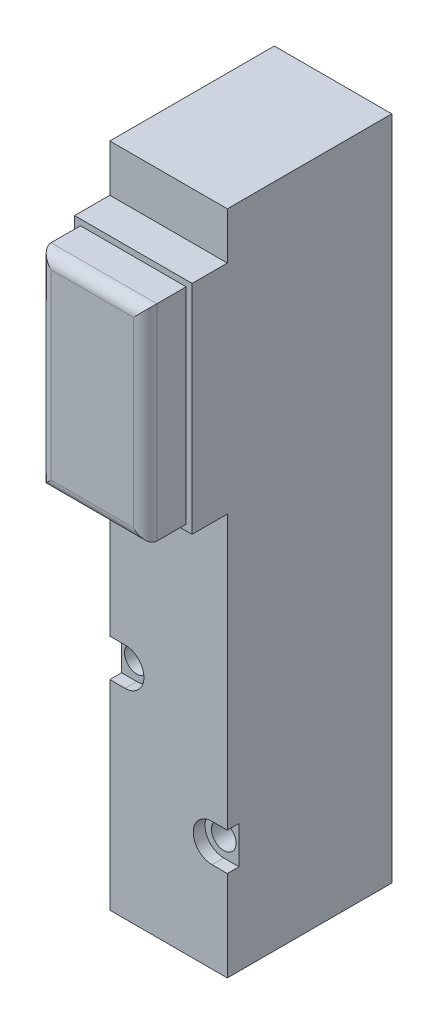
ISO-10303-21;
HEADER;
FILE_DESCRIPTION(('STEP AP214'),'2;1');
FILE_NAME('part.step','',(''),(''),'','','');
FILE_SCHEMA(('AUTOMOTIVE_DESIGN { 1 0 10303 214 1 1 1 1 }'));
ENDSEC;
DATA;
#1=APPLICATION_CONTEXT('core data for automotive mechanical design processes');
#2=APPLICATION_PROTOCOL_DEFINITION('international standard','automotive_design',2000,#1);
#3=PRODUCT_CONTEXT('',#1,'mechanical');
#4=PRODUCT('Part','Part','',(#3));
#5=PRODUCT_RELATED_PRODUCT_CATEGORY('part','',(#4));
#6=PRODUCT_DEFINITION_FORMATION('','',#4);
#7=PRODUCT_DEFINITION_CONTEXT('part definition',#1,'design');
#8=PRODUCT_DEFINITION('design','',#6,#7);
#9=PRODUCT_DEFINITION_SHAPE('','',#8);
#10=(LENGTH_UNIT() NAMED_UNIT(*) SI_UNIT(.MILLI.,.METRE.));
#11=(NAMED_UNIT(*) PLANE_ANGLE_UNIT() SI_UNIT($,.RADIAN.));
#12=(NAMED_UNIT(*) SI_UNIT($,.STERADIAN.) SOLID_ANGLE_UNIT());
#13=UNCERTAINTY_MEASURE_WITH_UNIT(LENGTH_MEASURE(1.E-05),#10,'distance_accuracy_value','');
#14=(GEOMETRIC_REPRESENTATION_CONTEXT(3) GLOBAL_UNCERTAINTY_ASSIGNED_CONTEXT((#13)) GLOBAL_UNIT_ASSIGNED_CONTEXT((#10,
#11,#12)) REPRESENTATION_CONTEXT('',''));
#15=CARTESIAN_POINT('',(0.,0.,0.));
#16=DIRECTION('',(0.,0.,1.));
#17=DIRECTION('',(1.,0.,0.));
#18=AXIS2_PLACEMENT_3D('',#15,#16,#17);
#19=CARTESIAN_POINT('',(-5.,-22.498,10.));
#20=DIRECTION('',(0.,0.,1.));
#21=DIRECTION('',(1.,0.,0.));
#22=AXIS2_PLACEMENT_3D('',#19,#20,#21);
#23=PLANE('',#22);
#24=DIRECTION('',(0.,-1.,0.));
#25=VECTOR('',#24,1.);
#26=CARTESIAN_POINT('',(-5.,-4.,10.));
#27=LINE('',#26,#25);
#28=CARTESIAN_POINT('',(-5.,-4.,10.));
#29=VERTEX_POINT('',#28);
#30=CARTESIAN_POINT('',(-5.,-22.498,10.));
#31=VERTEX_POINT('',#30);
#32=EDGE_CURVE('E352',#29,#31,#27,.T.);
#33=ORIENTED_EDGE('',*,*,#32,.T.);
#34=DIRECTION('',(1.,0.,0.));
#35=VECTOR('',#34,1.);
#36=CARTESIAN_POINT('',(-5.,-22.498,10.));
#37=LINE('',#36,#35);
#38=CARTESIAN_POINT('',(5.,-22.498,10.));
#39=VERTEX_POINT('',#38);
#40=EDGE_CURVE('E398',#31,#39,#37,.T.);
#41=ORIENTED_EDGE('',*,*,#40,.T.);
#42=DIRECTION('',(0.,1.,0.));
#43=VECTOR('',#42,1.);
#44=CARTESIAN_POINT('',(5.,-4.,10.));
#45=LINE('',#44,#43);
#46=CARTESIAN_POINT('',(5.,-4.,10.));
#47=VERTEX_POINT('',#46);
#48=EDGE_CURVE('E402',#39,#47,#45,.T.);
#49=ORIENTED_EDGE('',*,*,#48,.T.);
#50=DIRECTION('',(-1.,0.,0.));
#51=VECTOR('',#50,1.);
#52=CARTESIAN_POINT('',(-5.,-4.,10.));
#53=LINE('',#52,#51);
#54=EDGE_CURVE('E356',#47,#29,#53,.T.);
#55=ORIENTED_EDGE('',*,*,#54,.T.);
#56=EDGE_LOOP('',(#33,#41,#49,#55));
#57=FACE_BOUND('',#56,.T.);
#58=DIRECTION('',(0.,-1.,0.));
#59=VECTOR('',#58,1.);
#60=CARTESIAN_POINT('',(-4.5,-4.5,10.));
#61=LINE('',#60,#59);
#62=CARTESIAN_POINT('',(-4.5,-4.5,10.));
#63=VERTEX_POINT('',#62);
#64=CARTESIAN_POINT('',(-4.5,-21.998,10.));
#65=VERTEX_POINT('',#64);
#66=EDGE_CURVE('E198',#63,#65,#61,.T.);
#67=ORIENTED_EDGE('',*,*,#66,.F.);
#68=DIRECTION('',(-1.,0.,0.));
#69=VECTOR('',#68,1.);
#70=CARTESIAN_POINT('',(4.5,-4.5,10.));
#71=LINE('',#70,#69);
#72=CARTESIAN_POINT('',(4.5,-4.5,10.));
#73=VERTEX_POINT('',#72);
#74=EDGE_CURVE('E206',#73,#63,#71,.T.);
#75=ORIENTED_EDGE('',*,*,#74,.F.);
#76=DIRECTION('',(0.,1.,0.));
#77=VECTOR('',#76,1.);
#78=CARTESIAN_POINT('',(4.5,-21.998,10.));
#79=LINE('',#78,#77);
#80=CARTESIAN_POINT('',(4.5,-21.998,10.));
#81=VERTEX_POINT('',#80);
#82=EDGE_CURVE('E218',#81,#73,#79,.T.);
#83=ORIENTED_EDGE('',*,*,#82,.F.);
#84=DIRECTION('',(1.,0.,0.));
#85=VECTOR('',#84,1.);
#86=CARTESIAN_POINT('',(-4.5,-21.998,10.));
#87=LINE('',#86,#85);
#88=EDGE_CURVE('E216',#65,#81,#87,.T.);
#89=ORIENTED_EDGE('',*,*,#88,.F.);
#90=EDGE_LOOP('',(#67,#75,#83,#89));
#91=FACE_BOUND('',#90,.T.);
#92=ADVANCED_FACE('F33',(#57,#91),#23,.T.);
#93=CARTESIAN_POINT('',(-5.,-56.7,7.));
#94=DIRECTION('',(-1.,0.,0.));
#95=DIRECTION('',(0.,0.,1.));
#96=AXIS2_PLACEMENT_3D('',#93,#94,#95);
#97=PLANE('',#96);
#98=DIRECTION('',(0.,1.,0.));
#99=VECTOR('',#98,1.);
#100=CARTESIAN_POINT('',(-5.,-56.7,7.));
#101=LINE('',#100,#99);
#102=CARTESIAN_POINT('',(-5.,-56.7,7.));
#103=VERTEX_POINT('',#102);
#104=CARTESIAN_POINT('',(-5.,-39.7,7.));
#105=VERTEX_POINT('',#104);
#106=EDGE_CURVE('E381',#103,#105,#101,.T.);
#107=ORIENTED_EDGE('',*,*,#106,.T.);
#108=DIRECTION('',(0.,0.,1.));
#109=VECTOR('',#108,1.);
#110=CARTESIAN_POINT('',(-5.,-39.7,6.));
#111=LINE('',#110,#109);
#112=CARTESIAN_POINT('',(-5.,-39.7,6.));
#113=VERTEX_POINT('',#112);
#114=EDGE_CURVE('E252',#113,#105,#111,.T.);
#115=ORIENTED_EDGE('',*,*,#114,.F.);
#116=DIRECTION('',(0.,1.,0.));
#117=VECTOR('',#116,1.);
#118=CARTESIAN_POINT('',(-5.,-67.4571124722418,6.));
#119=LINE('',#118,#117);
#120=CARTESIAN_POINT('',(-5.,-36.5,6.));
#121=VERTEX_POINT('',#120);
#122=EDGE_CURVE('E242',#113,#121,#119,.T.);
#123=ORIENTED_EDGE('',*,*,#122,.T.);
#124=DIRECTION('',(0.,0.,1.));
#125=VECTOR('',#124,1.);
#126=CARTESIAN_POINT('',(-5.,-36.5,6.));
#127=LINE('',#126,#125);
#128=CARTESIAN_POINT('',(-5.,-36.5,7.));
#129=VERTEX_POINT('',#128);
#130=EDGE_CURVE('E254',#121,#129,#127,.T.);
#131=ORIENTED_EDGE('',*,*,#130,.T.);
#132=CARTESIAN_POINT('',(-5.,-22.498,7.));
#133=VERTEX_POINT('',#132);
#134=EDGE_CURVE('E366',#129,#133,#101,.T.);
#135=ORIENTED_EDGE('',*,*,#134,.T.);
#136=DIRECTION('',(0.,0.,-1.));
#137=VECTOR('',#136,1.);
#138=CARTESIAN_POINT('',(-5.,-22.498,10.));
#139=LINE('',#138,#137);
#140=EDGE_CURVE('E341',#31,#133,#139,.T.);
#141=ORIENTED_EDGE('',*,*,#140,.F.);
#142=ORIENTED_EDGE('',*,*,#32,.F.);
#143=DIRECTION('',(0.,0.,-1.));
#144=VECTOR('',#143,1.);
#145=CARTESIAN_POINT('',(-5.,-4.,10.));
#146=LINE('',#145,#144);
#147=CARTESIAN_POINT('',(-5.,-4.00000000000003,7.));
#148=VERTEX_POINT('',#147);
#149=EDGE_CURVE('E353',#29,#148,#146,.T.);
#150=ORIENTED_EDGE('',*,*,#149,.T.);
#151=CARTESIAN_POINT('',(-5.,0.,7.));
#152=VERTEX_POINT('',#151);
#153=EDGE_CURVE('E379',#148,#152,#101,.T.);
#154=ORIENTED_EDGE('',*,*,#153,.T.);
#155=DIRECTION('',(0.,0.,1.));
#156=VECTOR('',#155,1.);
#157=CARTESIAN_POINT('',(-5.,0.,7.));
#158=LINE('',#157,#156);
#159=CARTESIAN_POINT('',(-5.,0.,-7.));
#160=VERTEX_POINT('',#159);
#161=EDGE_CURVE('E347',#160,#152,#158,.T.);
#162=ORIENTED_EDGE('',*,*,#161,.F.);
#163=DIRECTION('',(0.,1.,0.));
#164=VECTOR('',#163,1.);
#165=CARTESIAN_POINT('',(-5.,-56.7,-7.));
#166=LINE('',#165,#164);
#167=CARTESIAN_POINT('',(-5.,-56.7,-7.));
#168=VERTEX_POINT('',#167);
#169=EDGE_CURVE('E429',#168,#160,#166,.T.);
#170=ORIENTED_EDGE('',*,*,#169,.F.);
#171=DIRECTION('',(0.,0.,1.));
#172=VECTOR('',#171,1.);
#173=CARTESIAN_POINT('',(-5.,-56.7,7.));
#174=LINE('',#173,#172);
#175=EDGE_CURVE('E420',#168,#103,#174,.T.);
#176=ORIENTED_EDGE('',*,*,#175,.T.);
#177=EDGE_LOOP('',(#107,#115,#123,#131,#135,#141,#142,#150,#154,#162,#170,#176));
#178=FACE_BOUND('',#177,.T.);
#179=ADVANCED_FACE('F35',(#178),#97,.T.);
#180=CARTESIAN_POINT('',(-5.,-56.7,7.));
#181=DIRECTION('',(0.,0.,1.));
#182=DIRECTION('',(1.,0.,0.));
#183=AXIS2_PLACEMENT_3D('',#180,#181,#182);
#184=PLANE('',#183);
#185=CARTESIAN_POINT('',(-3.7,-38.1,7.));
#186=DIRECTION('',(0.,0.,1.));
#187=DIRECTION('',(1.,0.,0.));
#188=AXIS2_PLACEMENT_3D('',#185,#186,#187);
#189=CIRCLE('',#188,1.6);
#190=CARTESIAN_POINT('',(-3.7,-39.7,7.));
#191=VERTEX_POINT('',#190);
#192=CARTESIAN_POINT('',(-3.7,-36.5,7.));
#193=VERTEX_POINT('',#192);
#194=EDGE_CURVE('E202',#191,#193,#189,.T.);
#195=ORIENTED_EDGE('',*,*,#194,.F.);
#196=DIRECTION('',(-1.,0.,0.));
#197=VECTOR('',#196,1.);
#198=CARTESIAN_POINT('',(0.,-39.7,7.));
#199=LINE('',#198,#197);
#200=EDGE_CURVE('E230',#191,#105,#199,.T.);
#201=ORIENTED_EDGE('',*,*,#200,.T.);
#202=ORIENTED_EDGE('',*,*,#106,.F.);
#203=DIRECTION('',(1.,0.,0.));
#204=VECTOR('',#203,1.);
#205=CARTESIAN_POINT('',(-5.,-56.7,7.));
#206=LINE('',#205,#204);
#207=CARTESIAN_POINT('',(5.,-56.7,7.));
#208=VERTEX_POINT('',#207);
#209=EDGE_CURVE('E422',#103,#208,#206,.T.);
#210=ORIENTED_EDGE('',*,*,#209,.T.);
#211=DIRECTION('',(0.,1.,0.));
#212=VECTOR('',#211,1.);
#213=CARTESIAN_POINT('',(5.,-56.7,7.));
#214=LINE('',#213,#212);
#215=CARTESIAN_POINT('',(5.,-49.,7.));
#216=VERTEX_POINT('',#215);
#217=EDGE_CURVE('E365',#208,#216,#214,.T.);
#218=ORIENTED_EDGE('',*,*,#217,.T.);
#219=DIRECTION('',(1.,0.,0.));
#220=VECTOR('',#219,1.);
#221=CARTESIAN_POINT('',(0.,-49.,7.));
#222=LINE('',#221,#220);
#223=CARTESIAN_POINT('',(3.7,-49.,7.));
#224=VERTEX_POINT('',#223);
#225=EDGE_CURVE('E264',#224,#216,#222,.T.);
#226=ORIENTED_EDGE('',*,*,#225,.F.);
#227=CARTESIAN_POINT('',(3.7,-47.4,7.));
#228=DIRECTION('',(0.,0.,1.));
#229=DIRECTION('',(1.,0.,0.));
#230=AXIS2_PLACEMENT_3D('',#227,#228,#229);
#231=CIRCLE('',#230,1.6);
#232=CARTESIAN_POINT('',(3.7,-45.8,7.));
#233=VERTEX_POINT('',#232);
#234=EDGE_CURVE('E261',#233,#224,#231,.T.);
#235=ORIENTED_EDGE('',*,*,#234,.F.);
#236=DIRECTION('',(1.,0.,0.));
#237=VECTOR('',#236,1.);
#238=CARTESIAN_POINT('',(0.,-45.8,7.));
#239=LINE('',#238,#237);
#240=CARTESIAN_POINT('',(5.,-45.8,7.));
#241=VERTEX_POINT('',#240);
#242=EDGE_CURVE('E251',#233,#241,#239,.T.);
#243=ORIENTED_EDGE('',*,*,#242,.T.);
#244=CARTESIAN_POINT('',(5.,-22.498,7.));
#245=VERTEX_POINT('',#244);
#246=EDGE_CURVE('E363',#241,#245,#214,.T.);
#247=ORIENTED_EDGE('',*,*,#246,.T.);
#248=DIRECTION('',(1.,0.,0.));
#249=VECTOR('',#248,1.);
#250=CARTESIAN_POINT('',(-5.,-22.498,7.));
#251=LINE('',#250,#249);
#252=EDGE_CURVE('E325',#133,#245,#251,.T.);
#253=ORIENTED_EDGE('',*,*,#252,.F.);
#254=ORIENTED_EDGE('',*,*,#134,.F.);
#255=DIRECTION('',(-1.,0.,0.));
#256=VECTOR('',#255,1.);
#257=CARTESIAN_POINT('',(0.,-36.5,7.));
#258=LINE('',#257,#256);
#259=EDGE_CURVE('E228',#193,#129,#258,.T.);
#260=ORIENTED_EDGE('',*,*,#259,.F.);
#261=EDGE_LOOP('',(#195,#201,#202,#210,#218,#226,#235,#243,#247,#253,#254,#260));
#262=FACE_BOUND('',#261,.T.);
#263=ADVANCED_FACE('F393',(#262),#184,.T.);
#264=CARTESIAN_POINT('',(-3.7,-38.1,-7.));
#265=DIRECTION('',(0.,0.,1.));
#266=DIRECTION('',(1.,0.,0.));
#267=AXIS2_PLACEMENT_3D('',#264,#265,#266);
#268=CYLINDRICAL_SURFACE('',#267,1.05);
#269=CARTESIAN_POINT('',(-3.7,-38.1,-7.));
#270=DIRECTION('',(0.,0.,1.));
#271=DIRECTION('',(1.,0.,0.));
#272=AXIS2_PLACEMENT_3D('',#269,#270,#271);
#273=CIRCLE('',#272,1.05);
#274=CARTESIAN_POINT('',(-2.65,-38.1,-7.));
#275=VERTEX_POINT('',#274);
#276=EDGE_CURVE('E292',#275,#275,#273,.T.);
#277=ORIENTED_EDGE('',*,*,#276,.F.);
#278=EDGE_LOOP('',(#277));
#279=FACE_BOUND('',#278,.T.);
#280=CARTESIAN_POINT('',(-3.7,-38.1,6.));
#281=DIRECTION('',(0.,0.,1.));
#282=DIRECTION('',(1.,0.,0.));
#283=AXIS2_PLACEMENT_3D('',#280,#281,#282);
#284=CIRCLE('',#283,1.05);
#285=CARTESIAN_POINT('',(-2.65,-38.1,6.));
#286=VERTEX_POINT('',#285);
#287=EDGE_CURVE('E233',#286,#286,#284,.T.);
#288=ORIENTED_EDGE('',*,*,#287,.T.);
#289=EDGE_LOOP('',(#288));
#290=FACE_BOUND('',#289,.T.);
#291=ADVANCED_FACE('F533',(#279,#290),#268,.F.);
#292=CARTESIAN_POINT('',(3.7,-47.4,-7.));
#293=DIRECTION('',(0.,0.,1.));
#294=DIRECTION('',(1.,0.,0.));
#295=AXIS2_PLACEMENT_3D('',#292,#293,#294);
#296=CYLINDRICAL_SURFACE('',#295,1.05);
#297=CARTESIAN_POINT('',(3.7,-47.4,-7.));
#298=DIRECTION('',(0.,0.,1.));
#299=DIRECTION('',(1.,0.,0.));
#300=AXIS2_PLACEMENT_3D('',#297,#298,#299);
#301=CIRCLE('',#300,1.05);
#302=CARTESIAN_POINT('',(4.75,-47.4,-7.));
#303=VERTEX_POINT('',#302);
#304=EDGE_CURVE('E284',#303,#303,#301,.T.);
#305=ORIENTED_EDGE('',*,*,#304,.F.);
#306=EDGE_LOOP('',(#305));
#307=FACE_BOUND('',#306,.T.);
#308=CARTESIAN_POINT('',(3.7,-47.4,6.));
#309=DIRECTION('',(0.,0.,1.));
#310=DIRECTION('',(1.,0.,0.));
#311=AXIS2_PLACEMENT_3D('',#308,#309,#310);
#312=CIRCLE('',#311,1.05);
#313=CARTESIAN_POINT('',(4.75,-47.4,6.));
#314=VERTEX_POINT('',#313);
#315=EDGE_CURVE('E266',#314,#314,#312,.T.);
#316=ORIENTED_EDGE('',*,*,#315,.T.);
#317=EDGE_LOOP('',(#316));
#318=FACE_BOUND('',#317,.T.);
#319=ADVANCED_FACE('F457',(#307,#318),#296,.F.);
#320=DIRECTION('',(-1.,0.,0.));
#321=VECTOR('',#320,1.);
#322=CARTESIAN_POINT('',(-5.,-4.,7.));
#323=LINE('',#322,#321);
#324=CARTESIAN_POINT('',(5.,-4.00000000000003,7.));
#325=VERTEX_POINT('',#324);
#326=EDGE_CURVE('E334',#325,#148,#323,.T.);
#327=ORIENTED_EDGE('',*,*,#326,.F.);
#328=CARTESIAN_POINT('',(5.,0.,7.));
#329=VERTEX_POINT('',#328);
#330=EDGE_CURVE('E335',#325,#329,#214,.T.);
#331=ORIENTED_EDGE('',*,*,#330,.T.);
#332=DIRECTION('',(1.,0.,0.));
#333=VECTOR('',#332,1.);
#334=CARTESIAN_POINT('',(-5.,0.,7.));
#335=LINE('',#334,#333);
#336=EDGE_CURVE('E411',#152,#329,#335,.T.);
#337=ORIENTED_EDGE('',*,*,#336,.F.);
#338=ORIENTED_EDGE('',*,*,#153,.F.);
#339=EDGE_LOOP('',(#327,#331,#337,#338));
#340=FACE_BOUND('',#339,.T.);
#341=ADVANCED_FACE('F446',(#340),#184,.T.);
#342=CARTESIAN_POINT('',(-5.,-56.7,-7.));
#343=DIRECTION('',(0.,0.,-1.));
#344=DIRECTION('',(-1.,0.,0.));
#345=AXIS2_PLACEMENT_3D('',#342,#343,#344);
#346=PLANE('',#345);
#347=ORIENTED_EDGE('',*,*,#304,.T.);
#348=EDGE_LOOP('',(#347));
#349=FACE_BOUND('',#348,.T.);
#350=ORIENTED_EDGE('',*,*,#276,.T.);
#351=EDGE_LOOP('',(#350));
#352=FACE_BOUND('',#351,.T.);
#353=CARTESIAN_POINT('',(0.,-36.2,-7.));
#354=DIRECTION('',(0.,0.,-1.));
#355=DIRECTION('',(-1.,0.,0.));
#356=AXIS2_PLACEMENT_3D('',#353,#354,#355);
#357=CIRCLE('',#356,1.25);
#358=CARTESIAN_POINT('',(-1.25,-36.2,-7.));
#359=VERTEX_POINT('',#358);
#360=EDGE_CURVE('E298',#359,#359,#357,.T.);
#361=ORIENTED_EDGE('',*,*,#360,.F.);
#362=EDGE_LOOP('',(#361));
#363=FACE_BOUND('',#362,.T.);
#364=CARTESIAN_POINT('',(0.,-42.6,-7.));
#365=DIRECTION('',(0.,0.,-1.));
#366=DIRECTION('',(-1.,0.,0.));
#367=AXIS2_PLACEMENT_3D('',#364,#365,#366);
#368=CIRCLE('',#367,1.25);
#369=CARTESIAN_POINT('',(-1.25,-42.6,-7.));
#370=VERTEX_POINT('',#369);
#371=EDGE_CURVE('E304',#370,#370,#368,.T.);
#372=ORIENTED_EDGE('',*,*,#371,.F.);
#373=EDGE_LOOP('',(#372));
#374=FACE_BOUND('',#373,.T.);
#375=CARTESIAN_POINT('',(0.,-49.,-7.));
#376=DIRECTION('',(0.,0.,-1.));
#377=DIRECTION('',(-1.,0.,0.));
#378=AXIS2_PLACEMENT_3D('',#375,#376,#377);
#379=CIRCLE('',#378,1.25);
#380=CARTESIAN_POINT('',(-1.25,-49.,-7.));
#381=VERTEX_POINT('',#380);
#382=EDGE_CURVE('E310',#381,#381,#379,.T.);
#383=ORIENTED_EDGE('',*,*,#382,.F.);
#384=EDGE_LOOP('',(#383));
#385=FACE_BOUND('',#384,.T.);
#386=CARTESIAN_POINT('',(-2.,-45.8,-7.));
#387=DIRECTION('',(0.,0.,-1.));
#388=DIRECTION('',(-1.,0.,0.));
#389=AXIS2_PLACEMENT_3D('',#386,#387,#388);
#390=CIRCLE('',#389,1.25);
#391=CARTESIAN_POINT('',(-3.25,-45.8,-7.));
#392=VERTEX_POINT('',#391);
#393=EDGE_CURVE('E316',#392,#392,#390,.T.);
#394=ORIENTED_EDGE('',*,*,#393,.F.);
#395=EDGE_LOOP('',(#394));
#396=FACE_BOUND('',#395,.T.);
#397=CARTESIAN_POINT('',(2.,-39.4,-7.));
#398=DIRECTION('',(0.,0.,-1.));
#399=DIRECTION('',(-1.,0.,0.));
#400=AXIS2_PLACEMENT_3D('',#397,#398,#399);
#401=CIRCLE('',#400,1.25);
#402=CARTESIAN_POINT('',(0.75,-39.4,-7.));
#403=VERTEX_POINT('',#402);
#404=EDGE_CURVE('E322',#403,#403,#401,.T.);
#405=ORIENTED_EDGE('',*,*,#404,.F.);
#406=EDGE_LOOP('',(#405));
#407=FACE_BOUND('',#406,.T.);
#408=DIRECTION('',(-1.,0.,0.));
#409=VECTOR('',#408,1.);
#410=CARTESIAN_POINT('',(-5.,0.,-7.));
#411=LINE('',#410,#409);
#412=CARTESIAN_POINT('',(5.,0.,-7.));
#413=VERTEX_POINT('',#412);
#414=EDGE_CURVE('E417',#413,#160,#411,.T.);
#415=ORIENTED_EDGE('',*,*,#414,.F.);
#416=DIRECTION('',(0.,1.,0.));
#417=VECTOR('',#416,1.);
#418=CARTESIAN_POINT('',(5.,-56.7,-7.));
#419=LINE('',#418,#417);
#420=CARTESIAN_POINT('',(5.,-56.7,-7.));
#421=VERTEX_POINT('',#420);
#422=EDGE_CURVE('E371',#421,#413,#419,.T.);
#423=ORIENTED_EDGE('',*,*,#422,.F.);
#424=DIRECTION('',(-1.,0.,0.));
#425=VECTOR('',#424,1.);
#426=CARTESIAN_POINT('',(-5.,-56.7,-7.));
#427=LINE('',#426,#425);
#428=EDGE_CURVE('E380',#421,#168,#427,.T.);
#429=ORIENTED_EDGE('',*,*,#428,.T.);
#430=ORIENTED_EDGE('',*,*,#169,.T.);
#431=EDGE_LOOP('',(#415,#423,#429,#430));
#432=FACE_BOUND('',#431,.T.);
#433=ADVANCED_FACE('F444',(#349,#352,#363,#374,#385,#396,#407,#432),#346,.T.);
#434=CARTESIAN_POINT('',(5.,-56.7,7.));
#435=DIRECTION('',(1.,0.,0.));
#436=DIRECTION('',(0.,0.,-1.));
#437=AXIS2_PLACEMENT_3D('',#434,#435,#436);
#438=PLANE('',#437);
#439=DIRECTION('',(0.,0.,1.));
#440=VECTOR('',#439,1.);
#441=CARTESIAN_POINT('',(5.,-49.,6.));
#442=LINE('',#441,#440);
#443=CARTESIAN_POINT('',(5.,-49.,6.));
#444=VERTEX_POINT('',#443);
#445=EDGE_CURVE('E281',#444,#216,#442,.T.);
#446=ORIENTED_EDGE('',*,*,#445,.T.);
#447=ORIENTED_EDGE('',*,*,#217,.F.);
#448=DIRECTION('',(0.,0.,-1.));
#449=VECTOR('',#448,1.);
#450=CARTESIAN_POINT('',(5.,-56.7,7.));
#451=LINE('',#450,#449);
#452=EDGE_CURVE('E425',#208,#421,#451,.T.);
#453=ORIENTED_EDGE('',*,*,#452,.T.);
#454=ORIENTED_EDGE('',*,*,#422,.T.);
#455=DIRECTION('',(0.,0.,-1.));
#456=VECTOR('',#455,1.);
#457=CARTESIAN_POINT('',(5.,0.,7.));
#458=LINE('',#457,#456);
#459=EDGE_CURVE('E414',#329,#413,#458,.T.);
#460=ORIENTED_EDGE('',*,*,#459,.F.);
#461=ORIENTED_EDGE('',*,*,#330,.F.);
#462=DIRECTION('',(0.,0.,-1.));
#463=VECTOR('',#462,1.);
#464=CARTESIAN_POINT('',(5.,-4.,10.));
#465=LINE('',#464,#463);
#466=EDGE_CURVE('E342',#47,#325,#465,.T.);
#467=ORIENTED_EDGE('',*,*,#466,.F.);
#468=ORIENTED_EDGE('',*,*,#48,.F.);
#469=DIRECTION('',(0.,0.,-1.));
#470=VECTOR('',#469,1.);
#471=CARTESIAN_POINT('',(5.,-22.498,10.));
#472=LINE('',#471,#470);
#473=EDGE_CURVE('E338',#39,#245,#472,.T.);
#474=ORIENTED_EDGE('',*,*,#473,.T.);
#475=ORIENTED_EDGE('',*,*,#246,.F.);
#476=DIRECTION('',(0.,0.,1.));
#477=VECTOR('',#476,1.);
#478=CARTESIAN_POINT('',(5.,-45.8,6.));
#479=LINE('',#478,#477);
#480=CARTESIAN_POINT('',(5.,-45.8,6.));
#481=VERTEX_POINT('',#480);
#482=EDGE_CURVE('E280',#481,#241,#479,.T.);
#483=ORIENTED_EDGE('',*,*,#482,.F.);
#484=DIRECTION('',(0.,1.,0.));
#485=VECTOR('',#484,1.);
#486=CARTESIAN_POINT('',(5.,-67.4571124722418,6.));
#487=LINE('',#486,#485);
#488=EDGE_CURVE('E269',#444,#481,#487,.T.);
#489=ORIENTED_EDGE('',*,*,#488,.F.);
#490=EDGE_LOOP('',(#446,#447,#453,#454,#460,#461,#467,#468,#474,#475,#483,#489));
#491=FACE_BOUND('',#490,.T.);
#492=ADVANCED_FACE('F437',(#491),#438,.T.);
#493=CARTESIAN_POINT('',(-5.,-56.7,7.));
#494=DIRECTION('',(0.,-1.,0.));
#495=DIRECTION('',(0.,0.,-1.));
#496=AXIS2_PLACEMENT_3D('',#493,#494,#495);
#497=PLANE('',#496);
#498=ORIENTED_EDGE('',*,*,#175,.F.);
#499=ORIENTED_EDGE('',*,*,#428,.F.);
#500=ORIENTED_EDGE('',*,*,#452,.F.);
#501=ORIENTED_EDGE('',*,*,#209,.F.);
#502=EDGE_LOOP('',(#498,#499,#500,#501));
#503=FACE_BOUND('',#502,.T.);
#504=ADVANCED_FACE('F454',(#503),#497,.T.);
#505=CARTESIAN_POINT('',(-5.,0.,7.));
#506=DIRECTION('',(0.,-1.,0.));
#507=DIRECTION('',(0.,0.,-1.));
#508=AXIS2_PLACEMENT_3D('',#505,#506,#507);
#509=PLANE('',#508);
#510=ORIENTED_EDGE('',*,*,#161,.T.);
#511=ORIENTED_EDGE('',*,*,#336,.T.);
#512=ORIENTED_EDGE('',*,*,#459,.T.);
#513=ORIENTED_EDGE('',*,*,#414,.T.);
#514=EDGE_LOOP('',(#510,#511,#512,#513));
#515=FACE_BOUND('',#514,.T.);
#516=ADVANCED_FACE('F442',(#515),#509,.F.);
#517=CARTESIAN_POINT('',(-5.,-22.498,10.));
#518=DIRECTION('',(0.,1.,0.));
#519=DIRECTION('',(0.,0.,1.));
#520=AXIS2_PLACEMENT_3D('',#517,#518,#519);
#521=PLANE('',#520);
#522=ORIENTED_EDGE('',*,*,#252,.T.);
#523=ORIENTED_EDGE('',*,*,#473,.F.);
#524=ORIENTED_EDGE('',*,*,#40,.F.);
#525=ORIENTED_EDGE('',*,*,#140,.T.);
#526=EDGE_LOOP('',(#522,#523,#524,#525));
#527=FACE_BOUND('',#526,.T.);
#528=ADVANCED_FACE('F397',(#527),#521,.F.);
#529=CARTESIAN_POINT('',(-5.,-4.,10.));
#530=DIRECTION('',(0.,-1.,0.));
#531=DIRECTION('',(1.,0.,0.));
#532=AXIS2_PLACEMENT_3D('',#529,#530,#531);
#533=PLANE('',#532);
#534=ORIENTED_EDGE('',*,*,#326,.T.);
#535=ORIENTED_EDGE('',*,*,#149,.F.);
#536=ORIENTED_EDGE('',*,*,#54,.F.);
#537=ORIENTED_EDGE('',*,*,#466,.T.);
#538=EDGE_LOOP('',(#534,#535,#536,#537));
#539=FACE_BOUND('',#538,.T.);
#540=ADVANCED_FACE('F471',(#539),#533,.F.);
#541=CARTESIAN_POINT('',(2.,-39.4,-7.));
#542=DIRECTION('',(0.,0.,-1.));
#543=DIRECTION('',(-1.,0.,0.));
#544=AXIS2_PLACEMENT_3D('',#541,#542,#543);
#545=CYLINDRICAL_SURFACE('',#544,1.25);
#546=CARTESIAN_POINT('',(2.,-39.4,0.5));
#547=DIRECTION('',(0.,0.,-1.));
#548=DIRECTION('',(-1.,0.,0.));
#549=AXIS2_PLACEMENT_3D('',#546,#547,#548);
#550=CIRCLE('',#549,1.25);
#551=CARTESIAN_POINT('',(0.750000000000002,-39.4,0.5));
#552=VERTEX_POINT('',#551);
#553=EDGE_CURVE('E319',#552,#552,#550,.T.);
#554=ORIENTED_EDGE('',*,*,#553,.F.);
#555=EDGE_LOOP('',(#554));
#556=FACE_BOUND('',#555,.T.);
#557=ORIENTED_EDGE('',*,*,#404,.T.);
#558=EDGE_LOOP('',(#557));
#559=FACE_BOUND('',#558,.T.);
#560=ADVANCED_FACE('F469',(#556,#559),#545,.F.);
#561=CARTESIAN_POINT('',(2.,-39.4,0.5));
#562=DIRECTION('',(0.,0.,-1.));
#563=DIRECTION('',(-1.,0.,0.));
#564=AXIS2_PLACEMENT_3D('',#561,#562,#563);
#565=CONICAL_SURFACE('',#564,1.25,1.39626340159546);
#566=CARTESIAN_POINT('',(2.,-39.4,0.720408725885582));
#567=VERTEX_POINT('',#566);
#568=VERTEX_LOOP('',#567);
#569=FACE_BOUND('',#568,.T.);
#570=ORIENTED_EDGE('',*,*,#553,.T.);
#571=EDGE_LOOP('',(#570));
#572=FACE_BOUND('',#571,.T.);
#573=ADVANCED_FACE('F566',(#569,#572),#565,.F.);
#574=CARTESIAN_POINT('',(-2.,-45.8,-7.));
#575=DIRECTION('',(0.,0.,-1.));
#576=DIRECTION('',(-1.,0.,0.));
#577=AXIS2_PLACEMENT_3D('',#574,#575,#576);
#578=CYLINDRICAL_SURFACE('',#577,1.25);
#579=CARTESIAN_POINT('',(-2.,-45.8,0.5));
#580=DIRECTION('',(0.,0.,-1.));
#581=DIRECTION('',(-1.,0.,0.));
#582=AXIS2_PLACEMENT_3D('',#579,#580,#581);
#583=CIRCLE('',#582,1.25);
#584=CARTESIAN_POINT('',(-3.25,-45.8,0.5));
#585=VERTEX_POINT('',#584);
#586=EDGE_CURVE('E313',#585,#585,#583,.T.);
#587=ORIENTED_EDGE('',*,*,#586,.F.);
#588=EDGE_LOOP('',(#587));
#589=FACE_BOUND('',#588,.T.);
#590=ORIENTED_EDGE('',*,*,#393,.T.);
#591=EDGE_LOOP('',(#590));
#592=FACE_BOUND('',#591,.T.);
#593=ADVANCED_FACE('F563',(#589,#592),#578,.F.);
#594=CARTESIAN_POINT('',(-2.,-45.8,0.5));
#595=DIRECTION('',(0.,0.,-1.));
#596=DIRECTION('',(-1.,0.,0.));
#597=AXIS2_PLACEMENT_3D('',#594,#595,#596);
#598=CONICAL_SURFACE('',#597,1.25,1.39626340159546);
#599=CARTESIAN_POINT('',(-2.,-45.8,0.720408725885583));
#600=VERTEX_POINT('',#599);
#601=VERTEX_LOOP('',#600);
#602=FACE_BOUND('',#601,.T.);
#603=ORIENTED_EDGE('',*,*,#586,.T.);
#604=EDGE_LOOP('',(#603));
#605=FACE_BOUND('',#604,.T.);
#606=ADVANCED_FACE('F559',(#602,#605),#598,.F.);
#607=CARTESIAN_POINT('',(0.,-49.,-7.));
#608=DIRECTION('',(0.,0.,-1.));
#609=DIRECTION('',(-1.,0.,0.));
#610=AXIS2_PLACEMENT_3D('',#607,#608,#609);
#611=CYLINDRICAL_SURFACE('',#610,1.25);
#612=CARTESIAN_POINT('',(0.,-49.,0.5));
#613=DIRECTION('',(0.,0.,-1.));
#614=DIRECTION('',(-1.,0.,0.));
#615=AXIS2_PLACEMENT_3D('',#612,#613,#614);
#616=CIRCLE('',#615,1.25);
#617=CARTESIAN_POINT('',(-1.25,-49.,0.5));
#618=VERTEX_POINT('',#617);
#619=EDGE_CURVE('E307',#618,#618,#616,.T.);
#620=ORIENTED_EDGE('',*,*,#619,.F.);
#621=EDGE_LOOP('',(#620));
#622=FACE_BOUND('',#621,.T.);
#623=ORIENTED_EDGE('',*,*,#382,.T.);
#624=EDGE_LOOP('',(#623));
#625=FACE_BOUND('',#624,.T.);
#626=ADVANCED_FACE('F555',(#622,#625),#611,.F.);
#627=CARTESIAN_POINT('',(0.,-49.,0.5));
#628=DIRECTION('',(0.,0.,-1.));
#629=DIRECTION('',(-1.,0.,0.));
#630=AXIS2_PLACEMENT_3D('',#627,#628,#629);
#631=CONICAL_SURFACE('',#630,1.25,1.39626340159546);
#632=CARTESIAN_POINT('',(0.,-49.,0.720408725885582));
#633=VERTEX_POINT('',#632);
#634=VERTEX_LOOP('',#633);
#635=FACE_BOUND('',#634,.T.);
#636=ORIENTED_EDGE('',*,*,#619,.T.);
#637=EDGE_LOOP('',(#636));
#638=FACE_BOUND('',#637,.T.);
#639=ADVANCED_FACE('F551',(#635,#638),#631,.F.);
#640=CARTESIAN_POINT('',(0.,-42.6,-7.));
#641=DIRECTION('',(0.,0.,-1.));
#642=DIRECTION('',(-1.,0.,0.));
#643=AXIS2_PLACEMENT_3D('',#640,#641,#642);
#644=CYLINDRICAL_SURFACE('',#643,1.25);
#645=CARTESIAN_POINT('',(0.,-42.6,0.5));
#646=DIRECTION('',(0.,0.,-1.));
#647=DIRECTION('',(-1.,0.,0.));
#648=AXIS2_PLACEMENT_3D('',#645,#646,#647);
#649=CIRCLE('',#648,1.25);
#650=CARTESIAN_POINT('',(-1.25,-42.6,0.5));
#651=VERTEX_POINT('',#650);
#652=EDGE_CURVE('E301',#651,#651,#649,.T.);
#653=ORIENTED_EDGE('',*,*,#652,.F.);
#654=EDGE_LOOP('',(#653));
#655=FACE_BOUND('',#654,.T.);
#656=ORIENTED_EDGE('',*,*,#371,.T.);
#657=EDGE_LOOP('',(#656));
#658=FACE_BOUND('',#657,.T.);
#659=ADVANCED_FACE('F547',(#655,#658),#644,.F.);
#660=CARTESIAN_POINT('',(0.,-42.6,0.5));
#661=DIRECTION('',(0.,0.,-1.));
#662=DIRECTION('',(-1.,0.,0.));
#663=AXIS2_PLACEMENT_3D('',#660,#661,#662);
#664=CONICAL_SURFACE('',#663,1.25,1.39626340159546);
#665=CARTESIAN_POINT('',(0.,-42.6,0.720408725885582));
#666=VERTEX_POINT('',#665);
#667=VERTEX_LOOP('',#666);
#668=FACE_BOUND('',#667,.T.);
#669=ORIENTED_EDGE('',*,*,#652,.T.);
#670=EDGE_LOOP('',(#669));
#671=FACE_BOUND('',#670,.T.);
#672=ADVANCED_FACE('F543',(#668,#671),#664,.F.);
#673=CARTESIAN_POINT('',(0.,-36.2,-7.));
#674=DIRECTION('',(0.,0.,-1.));
#675=DIRECTION('',(-1.,0.,0.));
#676=AXIS2_PLACEMENT_3D('',#673,#674,#675);
#677=CYLINDRICAL_SURFACE('',#676,1.25);
#678=CARTESIAN_POINT('',(0.,-36.2,0.5));
#679=DIRECTION('',(0.,0.,-1.));
#680=DIRECTION('',(-1.,0.,0.));
#681=AXIS2_PLACEMENT_3D('',#678,#679,#680);
#682=CIRCLE('',#681,1.25);
#683=CARTESIAN_POINT('',(-1.25,-36.2,0.5));
#684=VERTEX_POINT('',#683);
#685=EDGE_CURVE('E295',#684,#684,#682,.T.);
#686=ORIENTED_EDGE('',*,*,#685,.F.);
#687=EDGE_LOOP('',(#686));
#688=FACE_BOUND('',#687,.T.);
#689=ORIENTED_EDGE('',*,*,#360,.T.);
#690=EDGE_LOOP('',(#689));
#691=FACE_BOUND('',#690,.T.);
#692=ADVANCED_FACE('F539',(#688,#691),#677,.F.);
#693=CARTESIAN_POINT('',(0.,-36.2,0.5));
#694=DIRECTION('',(0.,0.,-1.));
#695=DIRECTION('',(-1.,0.,0.));
#696=AXIS2_PLACEMENT_3D('',#693,#694,#695);
#697=CONICAL_SURFACE('',#696,1.25,1.39626340159546);
#698=CARTESIAN_POINT('',(0.,-36.2,0.720408725885582));
#699=VERTEX_POINT('',#698);
#700=VERTEX_LOOP('',#699);
#701=FACE_BOUND('',#700,.T.);
#702=ORIENTED_EDGE('',*,*,#685,.T.);
#703=EDGE_LOOP('',(#702));
#704=FACE_BOUND('',#703,.T.);
#705=ADVANCED_FACE('F526',(#701,#704),#697,.F.);
#706=CARTESIAN_POINT('',(0.,-49.,6.));
#707=DIRECTION('',(0.,-1.,0.));
#708=DIRECTION('',(0.,0.,-1.));
#709=AXIS2_PLACEMENT_3D('',#706,#707,#708);
#710=PLANE('',#709);
#711=ORIENTED_EDGE('',*,*,#225,.T.);
#712=ORIENTED_EDGE('',*,*,#445,.F.);
#713=DIRECTION('',(1.,0.,0.));
#714=VECTOR('',#713,1.);
#715=CARTESIAN_POINT('',(0.,-49.,6.));
#716=LINE('',#715,#714);
#717=CARTESIAN_POINT('',(3.7,-49.,6.));
#718=VERTEX_POINT('',#717);
#719=EDGE_CURVE('E277',#718,#444,#716,.T.);
#720=ORIENTED_EDGE('',*,*,#719,.F.);
#721=DIRECTION('',(0.,0.,1.));
#722=VECTOR('',#721,1.);
#723=CARTESIAN_POINT('',(3.7,-49.,6.));
#724=LINE('',#723,#722);
#725=EDGE_CURVE('E285',#718,#224,#724,.T.);
#726=ORIENTED_EDGE('',*,*,#725,.T.);
#727=EDGE_LOOP('',(#711,#712,#720,#726));
#728=FACE_BOUND('',#727,.T.);
#729=ADVANCED_FACE('F500',(#728),#710,.F.);
#730=CARTESIAN_POINT('',(3.7,-47.4,6.));
#731=DIRECTION('',(0.,0.,1.));
#732=DIRECTION('',(1.,0.,0.));
#733=AXIS2_PLACEMENT_3D('',#730,#731,#732);
#734=CYLINDRICAL_SURFACE('',#733,1.6);
#735=ORIENTED_EDGE('',*,*,#234,.T.);
#736=ORIENTED_EDGE('',*,*,#725,.F.);
#737=CARTESIAN_POINT('',(3.7,-47.4,6.));
#738=DIRECTION('',(0.,0.,1.));
#739=DIRECTION('',(1.,0.,0.));
#740=AXIS2_PLACEMENT_3D('',#737,#738,#739);
#741=CIRCLE('',#740,1.6);
#742=CARTESIAN_POINT('',(3.7,-45.8,6.));
#743=VERTEX_POINT('',#742);
#744=EDGE_CURVE('E274',#743,#718,#741,.T.);
#745=ORIENTED_EDGE('',*,*,#744,.F.);
#746=DIRECTION('',(0.,0.,1.));
#747=VECTOR('',#746,1.);
#748=CARTESIAN_POINT('',(3.7,-45.8,6.));
#749=LINE('',#748,#747);
#750=EDGE_CURVE('E287',#743,#233,#749,.T.);
#751=ORIENTED_EDGE('',*,*,#750,.T.);
#752=EDGE_LOOP('',(#735,#736,#745,#751));
#753=FACE_BOUND('',#752,.T.);
#754=ADVANCED_FACE('F494',(#753),#734,.F.);
#755=CARTESIAN_POINT('',(0.,-45.8,6.));
#756=DIRECTION('',(0.,-1.,0.));
#757=DIRECTION('',(0.,0.,-1.));
#758=AXIS2_PLACEMENT_3D('',#755,#756,#757);
#759=PLANE('',#758);
#760=ORIENTED_EDGE('',*,*,#242,.F.);
#761=ORIENTED_EDGE('',*,*,#750,.F.);
#762=DIRECTION('',(1.,0.,0.));
#763=VECTOR('',#762,1.);
#764=CARTESIAN_POINT('',(0.,-45.8,6.));
#765=LINE('',#764,#763);
#766=EDGE_CURVE('E272',#743,#481,#765,.T.);
#767=ORIENTED_EDGE('',*,*,#766,.T.);
#768=ORIENTED_EDGE('',*,*,#482,.T.);
#769=EDGE_LOOP('',(#760,#761,#767,#768));
#770=FACE_BOUND('',#769,.T.);
#771=ADVANCED_FACE('F489',(#770),#759,.T.);
#772=CARTESIAN_POINT('',(0.,-67.4571124722418,6.));
#773=DIRECTION('',(0.,0.,1.));
#774=DIRECTION('',(1.,0.,0.));
#775=AXIS2_PLACEMENT_3D('',#772,#773,#774);
#776=PLANE('',#775);
#777=ORIENTED_EDGE('',*,*,#315,.F.);
#778=EDGE_LOOP('',(#777));
#779=FACE_BOUND('',#778,.T.);
#780=ORIENTED_EDGE('',*,*,#488,.T.);
#781=ORIENTED_EDGE('',*,*,#766,.F.);
#782=ORIENTED_EDGE('',*,*,#744,.T.);
#783=ORIENTED_EDGE('',*,*,#719,.T.);
#784=EDGE_LOOP('',(#780,#781,#782,#783));
#785=FACE_BOUND('',#784,.T.);
#786=ADVANCED_FACE('F497',(#779,#785),#776,.T.);
#787=CARTESIAN_POINT('',(-3.7,-38.1,6.));
#788=DIRECTION('',(0.,0.,1.));
#789=DIRECTION('',(1.,0.,0.));
#790=AXIS2_PLACEMENT_3D('',#787,#788,#789);
#791=CYLINDRICAL_SURFACE('',#790,1.6);
#792=ORIENTED_EDGE('',*,*,#194,.T.);
#793=DIRECTION('',(0.,0.,1.));
#794=VECTOR('',#793,1.);
#795=CARTESIAN_POINT('',(-3.7,-36.5,6.));
#796=LINE('',#795,#794);
#797=CARTESIAN_POINT('',(-3.7,-36.5,6.));
#798=VERTEX_POINT('',#797);
#799=EDGE_CURVE('E248',#798,#193,#796,.T.);
#800=ORIENTED_EDGE('',*,*,#799,.F.);
#801=CARTESIAN_POINT('',(-3.7,-38.1,6.));
#802=DIRECTION('',(0.,0.,1.));
#803=DIRECTION('',(1.,0.,0.));
#804=AXIS2_PLACEMENT_3D('',#801,#802,#803);
#805=CIRCLE('',#804,1.6);
#806=CARTESIAN_POINT('',(-3.7,-39.7,6.));
#807=VERTEX_POINT('',#806);
#808=EDGE_CURVE('E236',#807,#798,#805,.T.);
#809=ORIENTED_EDGE('',*,*,#808,.F.);
#810=DIRECTION('',(0.,0.,1.));
#811=VECTOR('',#810,1.);
#812=CARTESIAN_POINT('',(-3.7,-39.7,6.));
#813=LINE('',#812,#811);
#814=EDGE_CURVE('E249',#807,#191,#813,.T.);
#815=ORIENTED_EDGE('',*,*,#814,.T.);
#816=EDGE_LOOP('',(#792,#800,#809,#815));
#817=FACE_BOUND('',#816,.T.);
#818=ADVANCED_FACE('F512',(#817),#791,.F.);
#819=CARTESIAN_POINT('',(0.,-39.7,6.));
#820=DIRECTION('',(0.,1.,0.));
#821=DIRECTION('',(0.,0.,1.));
#822=AXIS2_PLACEMENT_3D('',#819,#820,#821);
#823=PLANE('',#822);
#824=ORIENTED_EDGE('',*,*,#200,.F.);
#825=ORIENTED_EDGE('',*,*,#814,.F.);
#826=DIRECTION('',(-1.,0.,0.));
#827=VECTOR('',#826,1.);
#828=CARTESIAN_POINT('',(0.,-39.7,6.));
#829=LINE('',#828,#827);
#830=EDGE_CURVE('E245',#807,#113,#829,.T.);
#831=ORIENTED_EDGE('',*,*,#830,.T.);
#832=ORIENTED_EDGE('',*,*,#114,.T.);
#833=EDGE_LOOP('',(#824,#825,#831,#832));
#834=FACE_BOUND('',#833,.T.);
#835=ADVANCED_FACE('F503',(#834),#823,.T.);
#836=CARTESIAN_POINT('',(0.,-36.5,6.));
#837=DIRECTION('',(0.,1.,0.));
#838=DIRECTION('',(0.,0.,1.));
#839=AXIS2_PLACEMENT_3D('',#836,#837,#838);
#840=PLANE('',#839);
#841=ORIENTED_EDGE('',*,*,#259,.T.);
#842=ORIENTED_EDGE('',*,*,#130,.F.);
#843=DIRECTION('',(-1.,0.,0.));
#844=VECTOR('',#843,1.);
#845=CARTESIAN_POINT('',(0.,-36.5,6.));
#846=LINE('',#845,#844);
#847=EDGE_CURVE('E239',#798,#121,#846,.T.);
#848=ORIENTED_EDGE('',*,*,#847,.F.);
#849=ORIENTED_EDGE('',*,*,#799,.T.);
#850=EDGE_LOOP('',(#841,#842,#848,#849));
#851=FACE_BOUND('',#850,.T.);
#852=ADVANCED_FACE('F510',(#851),#840,.F.);
#853=CARTESIAN_POINT('',(0.,-67.4571124722418,6.));
#854=DIRECTION('',(0.,0.,1.));
#855=DIRECTION('',(1.,0.,0.));
#856=AXIS2_PLACEMENT_3D('',#853,#854,#855);
#857=PLANE('',#856);
#858=ORIENTED_EDGE('',*,*,#287,.F.);
#859=EDGE_LOOP('',(#858));
#860=FACE_BOUND('',#859,.T.);
#861=ORIENTED_EDGE('',*,*,#808,.T.);
#862=ORIENTED_EDGE('',*,*,#847,.T.);
#863=ORIENTED_EDGE('',*,*,#122,.F.);
#864=ORIENTED_EDGE('',*,*,#830,.F.);
#865=EDGE_LOOP('',(#861,#862,#863,#864));
#866=FACE_BOUND('',#865,.T.);
#867=ADVANCED_FACE('F506',(#860,#866),#857,.T.);
#868=CARTESIAN_POINT('',(4.5,-4.5,13.5));
#869=DIRECTION('',(0.,-1.,0.));
#870=DIRECTION('',(1.,0.,0.));
#871=AXIS2_PLACEMENT_3D('',#868,#869,#870);
#872=PLANE('',#871);
#873=DIRECTION('',(0.,0.,-1.));
#874=VECTOR('',#873,1.);
#875=CARTESIAN_POINT('',(-4.5,-4.5,13.5));
#876=LINE('',#875,#874);
#877=CARTESIAN_POINT('',(-4.5,-4.5,12.5));
#878=VERTEX_POINT('',#877);
#879=EDGE_CURVE('E194',#878,#63,#876,.T.);
#880=ORIENTED_EDGE('',*,*,#879,.F.);
#881=DIRECTION('',(-1.,0.,0.));
#882=VECTOR('',#881,1.);
#883=CARTESIAN_POINT('',(4.5,-4.5,12.5));
#884=LINE('',#883,#882);
#885=CARTESIAN_POINT('',(4.5,-4.5,12.5));
#886=VERTEX_POINT('',#885);
#887=EDGE_CURVE('E11',#878,#886,#884,.F.);
#888=ORIENTED_EDGE('',*,*,#887,.T.);
#889=DIRECTION('',(0.,0.,-1.));
#890=VECTOR('',#889,1.);
#891=CARTESIAN_POINT('',(4.5,-4.5,13.5));
#892=LINE('',#891,#890);
#893=EDGE_CURVE('E209',#886,#73,#892,.T.);
#894=ORIENTED_EDGE('',*,*,#893,.T.);
#895=ORIENTED_EDGE('',*,*,#74,.T.);
#896=EDGE_LOOP('',(#880,#888,#894,#895));
#897=FACE_BOUND('',#896,.T.);
#898=ADVANCED_FACE('F207',(#897),#872,.F.);
#899=CARTESIAN_POINT('',(-4.5,-4.5,13.5));
#900=DIRECTION('',(1.,0.,0.));
#901=DIRECTION('',(0.,1.,0.));
#902=AXIS2_PLACEMENT_3D('',#899,#900,#901);
#903=PLANE('',#902);
#904=DIRECTION('',(0.,0.,-1.));
#905=VECTOR('',#904,1.);
#906=CARTESIAN_POINT('',(-4.5,-21.998,13.5));
#907=LINE('',#906,#905);
#908=CARTESIAN_POINT('',(-4.5,-21.998,12.5));
#909=VERTEX_POINT('',#908);
#910=EDGE_CURVE('E203',#909,#65,#907,.T.);
#911=ORIENTED_EDGE('',*,*,#910,.F.);
#912=DIRECTION('',(0.,-1.,0.));
#913=VECTOR('',#912,1.);
#914=CARTESIAN_POINT('',(-4.5,-4.5,12.5));
#915=LINE('',#914,#913);
#916=EDGE_CURVE('E41',#909,#878,#915,.F.);
#917=ORIENTED_EDGE('',*,*,#916,.T.);
#918=ORIENTED_EDGE('',*,*,#879,.T.);
#919=ORIENTED_EDGE('',*,*,#66,.T.);
#920=EDGE_LOOP('',(#911,#917,#918,#919));
#921=FACE_BOUND('',#920,.T.);
#922=ADVANCED_FACE('F196',(#921),#903,.F.);
#923=CARTESIAN_POINT('',(-4.5,-21.998,13.5));
#924=DIRECTION('',(0.,1.,0.));
#925=DIRECTION('',(0.,0.,1.));
#926=AXIS2_PLACEMENT_3D('',#923,#924,#925);
#927=PLANE('',#926);
#928=DIRECTION('',(0.,0.,-1.));
#929=VECTOR('',#928,1.);
#930=CARTESIAN_POINT('',(4.5,-21.998,13.5));
#931=LINE('',#930,#929);
#932=CARTESIAN_POINT('',(4.5,-21.998,12.5));
#933=VERTEX_POINT('',#932);
#934=EDGE_CURVE('E224',#933,#81,#931,.T.);
#935=ORIENTED_EDGE('',*,*,#934,.F.);
#936=DIRECTION('',(1.,0.,0.));
#937=VECTOR('',#936,1.);
#938=CARTESIAN_POINT('',(-4.5,-21.998,12.5));
#939=LINE('',#938,#937);
#940=EDGE_CURVE('E55',#933,#909,#939,.F.);
#941=ORIENTED_EDGE('',*,*,#940,.T.);
#942=ORIENTED_EDGE('',*,*,#910,.T.);
#943=ORIENTED_EDGE('',*,*,#88,.T.);
#944=EDGE_LOOP('',(#935,#941,#942,#943));
#945=FACE_BOUND('',#944,.T.);
#946=ADVANCED_FACE('F692',(#945),#927,.F.);
#947=CARTESIAN_POINT('',(4.5,-21.998,13.5));
#948=DIRECTION('',(-1.,0.,0.));
#949=DIRECTION('',(0.,-1.,0.));
#950=AXIS2_PLACEMENT_3D('',#947,#948,#949);
#951=PLANE('',#950);
#952=ORIENTED_EDGE('',*,*,#893,.F.);
#953=DIRECTION('',(0.,1.,0.));
#954=VECTOR('',#953,1.);
#955=CARTESIAN_POINT('',(4.5,-21.998,12.5));
#956=LINE('',#955,#954);
#957=EDGE_CURVE('E753',#886,#933,#956,.F.);
#958=ORIENTED_EDGE('',*,*,#957,.T.);
#959=ORIENTED_EDGE('',*,*,#934,.T.);
#960=ORIENTED_EDGE('',*,*,#82,.T.);
#961=EDGE_LOOP('',(#952,#958,#959,#960));
#962=FACE_BOUND('',#961,.T.);
#963=ADVANCED_FACE('F699',(#962),#951,.F.);
#964=CARTESIAN_POINT('',(-4.5,-4.5,13.5));
#965=DIRECTION('',(0.,0.,1.));
#966=DIRECTION('',(1.,0.,0.));
#967=AXIS2_PLACEMENT_3D('',#964,#965,#966);
#968=PLANE('',#967);
#969=DIRECTION('',(1.,0.,0.));
#970=VECTOR('',#969,1.);
#971=CARTESIAN_POINT('',(4.5,-20.998,13.5));
#972=LINE('',#971,#970);
#973=CARTESIAN_POINT('',(-3.5,-20.998,13.5));
#974=VERTEX_POINT('',#973);
#975=CARTESIAN_POINT('',(3.5,-20.998,13.5));
#976=VERTEX_POINT('',#975);
#977=EDGE_CURVE('E770',#974,#976,#972,.T.);
#978=ORIENTED_EDGE('',*,*,#977,.T.);
#979=DIRECTION('',(0.,1.,0.));
#980=VECTOR('',#979,1.);
#981=CARTESIAN_POINT('',(3.5,-4.5,13.5));
#982=LINE('',#981,#980);
#983=CARTESIAN_POINT('',(3.5,-5.5,13.5));
#984=VERTEX_POINT('',#983);
#985=EDGE_CURVE('E756',#976,#984,#982,.T.);
#986=ORIENTED_EDGE('',*,*,#985,.T.);
#987=DIRECTION('',(-1.,0.,0.));
#988=VECTOR('',#987,1.);
#989=CARTESIAN_POINT('',(-4.5,-5.5,13.5));
#990=LINE('',#989,#988);
#991=CARTESIAN_POINT('',(-3.5,-5.5,13.5));
#992=VERTEX_POINT('',#991);
#993=EDGE_CURVE('E430',#984,#992,#990,.T.);
#994=ORIENTED_EDGE('',*,*,#993,.T.);
#995=DIRECTION('',(0.,-1.,0.));
#996=VECTOR('',#995,1.);
#997=CARTESIAN_POINT('',(-3.5,-21.998,13.5));
#998=LINE('',#997,#996);
#999=EDGE_CURVE('E434',#992,#974,#998,.T.);
#1000=ORIENTED_EDGE('',*,*,#999,.T.);
#1001=EDGE_LOOP('',(#978,#986,#994,#1000));
#1002=FACE_BOUND('',#1001,.T.);
#1003=ADVANCED_FACE('F706',(#1002),#968,.T.);
#1004=CARTESIAN_POINT('',(-3.5,-4.5,12.5));
#1005=DIRECTION('',(0.,1.,0.));
#1006=DIRECTION('',(-1.,0.,0.));
#1007=AXIS2_PLACEMENT_3D('',#1004,#1005,#1006);
#1008=CYLINDRICAL_SURFACE('',#1007,1.);
#1009=CARTESIAN_POINT('',(-3.5,-5.5,12.5));
#1010=DIRECTION('',(0.707106781186547,0.707106781186548,0.));
#1011=DIRECTION('',(0.707106781186548,-0.707106781186547,0.));
#1012=AXIS2_PLACEMENT_3D('',#1009,#1010,#1011);
#1013=ELLIPSE('',#1012,1.41421356237309,1.);
#1014=EDGE_CURVE('E758',#878,#992,#1013,.T.);
#1015=ORIENTED_EDGE('',*,*,#1014,.F.);
#1016=ORIENTED_EDGE('',*,*,#916,.F.);
#1017=CARTESIAN_POINT('',(-3.5,-20.998,12.5));
#1018=DIRECTION('',(-0.707106781186548,0.707106781186547,0.));
#1019=DIRECTION('',(0.707106781186547,0.707106781186548,0.));
#1020=AXIS2_PLACEMENT_3D('',#1017,#1018,#1019);
#1021=ELLIPSE('',#1020,1.41421356237309,1.);
#1022=EDGE_CURVE('E213',#974,#909,#1021,.F.);
#1023=ORIENTED_EDGE('',*,*,#1022,.F.);
#1024=ORIENTED_EDGE('',*,*,#999,.F.);
#1025=EDGE_LOOP('',(#1015,#1016,#1023,#1024));
#1026=FACE_BOUND('',#1025,.T.);
#1027=ADVANCED_FACE('F714',(#1026),#1008,.T.);
#1028=CARTESIAN_POINT('',(-4.5,-20.998,12.5));
#1029=DIRECTION('',(-1.,0.,0.));
#1030=DIRECTION('',(0.,0.,1.));
#1031=AXIS2_PLACEMENT_3D('',#1028,#1029,#1030);
#1032=CYLINDRICAL_SURFACE('',#1031,1.);
#1033=ORIENTED_EDGE('',*,*,#1022,.T.);
#1034=ORIENTED_EDGE('',*,*,#940,.F.);
#1035=CARTESIAN_POINT('',(3.5,-20.998,12.5));
#1036=DIRECTION('',(-0.707106781186547,-0.707106781186548,0.));
#1037=DIRECTION('',(-0.707106781186547,0.707106781186547,0.));
#1038=AXIS2_PLACEMENT_3D('',#1035,#1036,#1037);
#1039=ELLIPSE('',#1038,1.4142135623731,1.);
#1040=EDGE_CURVE('E751',#976,#933,#1039,.F.);
#1041=ORIENTED_EDGE('',*,*,#1040,.F.);
#1042=ORIENTED_EDGE('',*,*,#977,.F.);
#1043=EDGE_LOOP('',(#1033,#1034,#1041,#1042));
#1044=FACE_BOUND('',#1043,.T.);
#1045=ADVANCED_FACE('F722',(#1044),#1032,.T.);
#1046=CARTESIAN_POINT('',(-4.5,-5.5,12.5));
#1047=DIRECTION('',(1.,0.,0.));
#1048=DIRECTION('',(0.,1.,0.));
#1049=AXIS2_PLACEMENT_3D('',#1046,#1047,#1048);
#1050=CYLINDRICAL_SURFACE('',#1049,1.);
#1051=ORIENTED_EDGE('',*,*,#1014,.T.);
#1052=ORIENTED_EDGE('',*,*,#993,.F.);
#1053=CARTESIAN_POINT('',(3.5,-5.5,12.5));
#1054=DIRECTION('',(0.707106781186548,-0.707106781186547,0.));
#1055=DIRECTION('',(0.707106781186547,0.707106781186548,0.));
#1056=AXIS2_PLACEMENT_3D('',#1053,#1054,#1055);
#1057=ELLIPSE('',#1056,1.4142135623731,1.);
#1058=EDGE_CURVE('E759',#886,#984,#1057,.T.);
#1059=ORIENTED_EDGE('',*,*,#1058,.F.);
#1060=ORIENTED_EDGE('',*,*,#887,.F.);
#1061=EDGE_LOOP('',(#1051,#1052,#1059,#1060));
#1062=FACE_BOUND('',#1061,.T.);
#1063=ADVANCED_FACE('F730',(#1062),#1050,.T.);
#1064=CARTESIAN_POINT('',(3.5,-4.5,12.5));
#1065=DIRECTION('',(0.,-1.,0.));
#1066=DIRECTION('',(1.,0.,0.));
#1067=AXIS2_PLACEMENT_3D('',#1064,#1065,#1066);
#1068=CYLINDRICAL_SURFACE('',#1067,1.);
#1069=ORIENTED_EDGE('',*,*,#1040,.T.);
#1070=ORIENTED_EDGE('',*,*,#957,.F.);
#1071=ORIENTED_EDGE('',*,*,#1058,.T.);
#1072=ORIENTED_EDGE('',*,*,#985,.F.);
#1073=EDGE_LOOP('',(#1069,#1070,#1071,#1072));
#1074=FACE_BOUND('',#1073,.T.);
#1075=ADVANCED_FACE('F738',(#1074),#1068,.T.);
#1076=CLOSED_SHELL('',(#92,#179,#263,#291,#319,#341,#433,#492,#504,#516,#528,#540,#560,#573,
#593,#606,#626,#639,#659,#672,#692,#705,#729,#754,#771,#786,#818,#835,#852,#867,#898,#922,#946,
#963,#1003,#1027,#1045,#1063,#1075));
#1077=MANIFOLD_SOLID_BREP('B2',#1076);
#1078=ADVANCED_BREP_SHAPE_REPRESENTATION('',(#18,#1077),#14);
#1079=SHAPE_DEFINITION_REPRESENTATION(#9,#1078);
ENDSEC;
END-ISO-10303-21;
